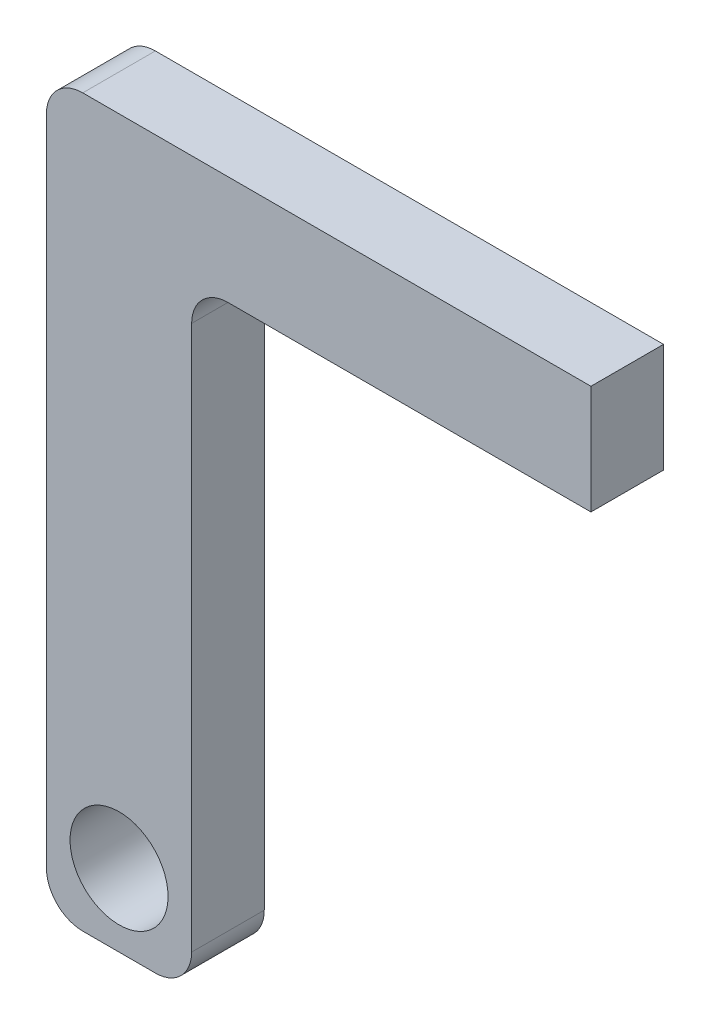
ISO-10303-21;
HEADER;
FILE_DESCRIPTION(('STEP AP214'),'2;1');
FILE_NAME('part.step','',(''),(''),'','','');
FILE_SCHEMA(('AUTOMOTIVE_DESIGN { 1 0 10303 214 1 1 1 1 }'));
ENDSEC;
DATA;
#1=APPLICATION_CONTEXT('core data for automotive mechanical design processes');
#2=APPLICATION_PROTOCOL_DEFINITION('international standard','automotive_design',2000,#1);
#3=PRODUCT_CONTEXT('',#1,'mechanical');
#4=PRODUCT('Part','Part','',(#3));
#5=PRODUCT_RELATED_PRODUCT_CATEGORY('part','',(#4));
#6=PRODUCT_DEFINITION_FORMATION('','',#4);
#7=PRODUCT_DEFINITION_CONTEXT('part definition',#1,'design');
#8=PRODUCT_DEFINITION('design','',#6,#7);
#9=PRODUCT_DEFINITION_SHAPE('','',#8);
#10=(LENGTH_UNIT() NAMED_UNIT(*) SI_UNIT(.MILLI.,.METRE.));
#11=(NAMED_UNIT(*) PLANE_ANGLE_UNIT() SI_UNIT($,.RADIAN.));
#12=(NAMED_UNIT(*) SI_UNIT($,.STERADIAN.) SOLID_ANGLE_UNIT());
#13=UNCERTAINTY_MEASURE_WITH_UNIT(LENGTH_MEASURE(1.E-05),#10,'distance_accuracy_value','');
#14=(GEOMETRIC_REPRESENTATION_CONTEXT(3) GLOBAL_UNCERTAINTY_ASSIGNED_CONTEXT((#13)) GLOBAL_UNIT_ASSIGNED_CONTEXT((#10,
#11,#12)) REPRESENTATION_CONTEXT('',''));
#15=CARTESIAN_POINT('',(0.,0.,0.));
#16=DIRECTION('',(0.,0.,1.));
#17=DIRECTION('',(1.,0.,0.));
#18=AXIS2_PLACEMENT_3D('',#15,#16,#17);
#19=CARTESIAN_POINT('',(20.,85.,20.));
#20=DIRECTION('',(-1.,0.,0.));
#21=DIRECTION('',(0.,-1.,0.));
#22=AXIS2_PLACEMENT_3D('',#19,#20,#21);
#23=PLANE('',#22);
#24=DIRECTION('',(0.,1.,0.));
#25=VECTOR('',#24,1.);
#26=CARTESIAN_POINT('',(20.,85.,0.));
#27=LINE('',#26,#25);
#28=CARTESIAN_POINT('',(20.,-75.,0.));
#29=VERTEX_POINT('',#28);
#30=CARTESIAN_POINT('',(20.,75.,0.));
#31=VERTEX_POINT('',#30);
#32=EDGE_CURVE('E129',#29,#31,#27,.T.);
#33=ORIENTED_EDGE('',*,*,#32,.T.);
#34=DIRECTION('',(0.,0.,-1.));
#35=VECTOR('',#34,1.);
#36=CARTESIAN_POINT('',(20.,75.,20.));
#37=LINE('',#36,#35);
#38=CARTESIAN_POINT('',(20.,75.,20.));
#39=VERTEX_POINT('',#38);
#40=EDGE_CURVE('E53',#31,#39,#37,.F.);
#41=ORIENTED_EDGE('',*,*,#40,.T.);
#42=DIRECTION('',(0.,1.,0.));
#43=VECTOR('',#42,1.);
#44=CARTESIAN_POINT('',(20.,85.,20.));
#45=LINE('',#44,#43);
#46=CARTESIAN_POINT('',(20.,-75.,20.));
#47=VERTEX_POINT('',#46);
#48=EDGE_CURVE('E185',#47,#39,#45,.T.);
#49=ORIENTED_EDGE('',*,*,#48,.F.);
#50=DIRECTION('',(0.,0.,-1.));
#51=VECTOR('',#50,1.);
#52=CARTESIAN_POINT('',(20.,-75.,20.));
#53=LINE('',#52,#51);
#54=EDGE_CURVE('E181',#47,#29,#53,.T.);
#55=ORIENTED_EDGE('',*,*,#54,.T.);
#56=EDGE_LOOP('',(#33,#41,#49,#55));
#57=FACE_BOUND('',#56,.T.);
#58=ADVANCED_FACE('F32',(#57),#23,.F.);
#59=CARTESIAN_POINT('',(-20.,85.,20.));
#60=DIRECTION('',(1.,0.,0.));
#61=DIRECTION('',(0.,1.,0.));
#62=AXIS2_PLACEMENT_3D('',#59,#60,#61);
#63=PLANE('',#62);
#64=DIRECTION('',(0.,-1.,0.));
#65=VECTOR('',#64,1.);
#66=CARTESIAN_POINT('',(-20.,85.,0.));
#67=LINE('',#66,#65);
#68=CARTESIAN_POINT('',(-20.,105.,0.));
#69=VERTEX_POINT('',#68);
#70=CARTESIAN_POINT('',(-20.,-75.,0.));
#71=VERTEX_POINT('',#70);
#72=EDGE_CURVE('E196',#69,#71,#67,.T.);
#73=ORIENTED_EDGE('',*,*,#72,.T.);
#74=DIRECTION('',(0.,0.,-1.));
#75=VECTOR('',#74,1.);
#76=CARTESIAN_POINT('',(-20.,-75.,20.));
#77=LINE('',#76,#75);
#78=CARTESIAN_POINT('',(-20.,-75.,20.));
#79=VERTEX_POINT('',#78);
#80=EDGE_CURVE('E155',#71,#79,#77,.F.);
#81=ORIENTED_EDGE('',*,*,#80,.T.);
#82=DIRECTION('',(0.,-1.,0.));
#83=VECTOR('',#82,1.);
#84=CARTESIAN_POINT('',(-20.,85.,20.));
#85=LINE('',#84,#83);
#86=CARTESIAN_POINT('',(-20.,105.,20.));
#87=VERTEX_POINT('',#86);
#88=EDGE_CURVE('E188',#87,#79,#85,.T.);
#89=ORIENTED_EDGE('',*,*,#88,.F.);
#90=DIRECTION('',(0.,0.,1.));
#91=VECTOR('',#90,1.);
#92=CARTESIAN_POINT('',(-20.,105.,0.));
#93=LINE('',#92,#91);
#94=EDGE_CURVE('E156',#87,#69,#93,.F.);
#95=ORIENTED_EDGE('',*,*,#94,.T.);
#96=EDGE_LOOP('',(#73,#81,#89,#95));
#97=FACE_BOUND('',#96,.T.);
#98=ADVANCED_FACE('F221',(#97),#63,.F.);
#99=CARTESIAN_POINT('',(-20.,-85.,20.));
#100=DIRECTION('',(0.,1.,0.));
#101=DIRECTION('',(0.,0.,1.));
#102=AXIS2_PLACEMENT_3D('',#99,#100,#101);
#103=PLANE('',#102);
#104=DIRECTION('',(1.,0.,0.));
#105=VECTOR('',#104,1.);
#106=CARTESIAN_POINT('',(-20.,-85.,0.));
#107=LINE('',#106,#105);
#108=CARTESIAN_POINT('',(-10.,-85.,0.));
#109=VERTEX_POINT('',#108);
#110=CARTESIAN_POINT('',(10.,-85.,0.));
#111=VERTEX_POINT('',#110);
#112=EDGE_CURVE('E189',#109,#111,#107,.T.);
#113=ORIENTED_EDGE('',*,*,#112,.T.);
#114=DIRECTION('',(0.,0.,-1.));
#115=VECTOR('',#114,1.);
#116=CARTESIAN_POINT('',(10.,-85.,20.));
#117=LINE('',#116,#115);
#118=CARTESIAN_POINT('',(10.,-85.,20.));
#119=VERTEX_POINT('',#118);
#120=EDGE_CURVE('E170',#111,#119,#117,.F.);
#121=ORIENTED_EDGE('',*,*,#120,.T.);
#122=DIRECTION('',(1.,0.,0.));
#123=VECTOR('',#122,1.);
#124=CARTESIAN_POINT('',(-20.,-85.,20.));
#125=LINE('',#124,#123);
#126=CARTESIAN_POINT('',(-10.,-85.,20.));
#127=VERTEX_POINT('',#126);
#128=EDGE_CURVE('E184',#127,#119,#125,.T.);
#129=ORIENTED_EDGE('',*,*,#128,.F.);
#130=DIRECTION('',(0.,0.,-1.));
#131=VECTOR('',#130,1.);
#132=CARTESIAN_POINT('',(-10.,-85.,20.));
#133=LINE('',#132,#131);
#134=EDGE_CURVE('E172',#127,#109,#133,.T.);
#135=ORIENTED_EDGE('',*,*,#134,.T.);
#136=EDGE_LOOP('',(#113,#121,#129,#135));
#137=FACE_BOUND('',#136,.T.);
#138=ADVANCED_FACE('F213',(#137),#103,.F.);
#139=CARTESIAN_POINT('',(0.,0.,20.));
#140=DIRECTION('',(0.,0.,1.));
#141=DIRECTION('',(1.,0.,0.));
#142=AXIS2_PLACEMENT_3D('',#139,#140,#141);
#143=PLANE('',#142);
#144=CARTESIAN_POINT('',(0.,-65.,20.));
#145=DIRECTION('',(0.,0.,1.));
#146=DIRECTION('',(1.,0.,0.));
#147=AXIS2_PLACEMENT_3D('',#144,#145,#146);
#148=CIRCLE('',#147,13.5);
#149=CARTESIAN_POINT('',(13.5,-65.,20.));
#150=VERTEX_POINT('',#149);
#151=EDGE_CURVE('E343',#150,#150,#148,.T.);
#152=ORIENTED_EDGE('',*,*,#151,.F.);
#153=EDGE_LOOP('',(#152));
#154=FACE_BOUND('',#153,.T.);
#155=ORIENTED_EDGE('',*,*,#128,.T.);
#156=CARTESIAN_POINT('',(10.,-75.,20.));
#157=DIRECTION('',(0.,0.,1.));
#158=DIRECTION('',(1.,0.,0.));
#159=AXIS2_PLACEMENT_3D('',#156,#157,#158);
#160=CIRCLE('',#159,10.);
#161=EDGE_CURVE('E162',#119,#47,#160,.T.);
#162=ORIENTED_EDGE('',*,*,#161,.T.);
#163=ORIENTED_EDGE('',*,*,#48,.T.);
#164=CARTESIAN_POINT('',(30.,75.,20.));
#165=DIRECTION('',(0.,0.,1.));
#166=DIRECTION('',(1.,0.,0.));
#167=AXIS2_PLACEMENT_3D('',#164,#165,#166);
#168=CIRCLE('',#167,10.);
#169=CARTESIAN_POINT('',(30.,85.,20.));
#170=VERTEX_POINT('',#169);
#171=EDGE_CURVE('E11',#39,#170,#168,.F.);
#172=ORIENTED_EDGE('',*,*,#171,.T.);
#173=DIRECTION('',(1.,0.,0.));
#174=VECTOR('',#173,1.);
#175=CARTESIAN_POINT('',(-20.,85.,20.));
#176=LINE('',#175,#174);
#177=CARTESIAN_POINT('',(130.,85.,20.));
#178=VERTEX_POINT('',#177);
#179=EDGE_CURVE('E126',#170,#178,#176,.T.);
#180=ORIENTED_EDGE('',*,*,#179,.T.);
#181=DIRECTION('',(0.,-1.,0.));
#182=VECTOR('',#181,1.);
#183=CARTESIAN_POINT('',(130.,115.,20.));
#184=LINE('',#183,#182);
#185=CARTESIAN_POINT('',(130.,115.,20.));
#186=VERTEX_POINT('',#185);
#187=EDGE_CURVE('E122',#186,#178,#184,.T.);
#188=ORIENTED_EDGE('',*,*,#187,.F.);
#189=DIRECTION('',(1.,0.,0.));
#190=VECTOR('',#189,1.);
#191=CARTESIAN_POINT('',(-20.,115.,20.));
#192=LINE('',#191,#190);
#193=CARTESIAN_POINT('',(-10.,115.,20.));
#194=VERTEX_POINT('',#193);
#195=EDGE_CURVE('E109',#194,#186,#192,.T.);
#196=ORIENTED_EDGE('',*,*,#195,.F.);
#197=CARTESIAN_POINT('',(-10.,105.,20.));
#198=DIRECTION('',(0.,0.,1.));
#199=DIRECTION('',(1.,0.,0.));
#200=AXIS2_PLACEMENT_3D('',#197,#198,#199);
#201=CIRCLE('',#200,10.);
#202=EDGE_CURVE('E168',#194,#87,#201,.T.);
#203=ORIENTED_EDGE('',*,*,#202,.T.);
#204=ORIENTED_EDGE('',*,*,#88,.T.);
#205=CARTESIAN_POINT('',(-10.,-75.,20.));
#206=DIRECTION('',(0.,0.,1.));
#207=DIRECTION('',(1.,0.,0.));
#208=AXIS2_PLACEMENT_3D('',#205,#206,#207);
#209=CIRCLE('',#208,10.);
#210=EDGE_CURVE('E166',#79,#127,#209,.T.);
#211=ORIENTED_EDGE('',*,*,#210,.T.);
#212=EDGE_LOOP('',(#155,#162,#163,#172,#180,#188,#196,#203,#204,#211));
#213=FACE_BOUND('',#212,.T.);
#214=ADVANCED_FACE('F124',(#154,#213),#143,.T.);
#215=CARTESIAN_POINT('',(0.,0.,0.));
#216=DIRECTION('',(0.,0.,1.));
#217=DIRECTION('',(1.,0.,0.));
#218=AXIS2_PLACEMENT_3D('',#215,#216,#217);
#219=PLANE('',#218);
#220=CARTESIAN_POINT('',(0.,-65.,0.));
#221=DIRECTION('',(0.,0.,1.));
#222=DIRECTION('',(1.,0.,0.));
#223=AXIS2_PLACEMENT_3D('',#220,#221,#222);
#224=CIRCLE('',#223,13.5);
#225=CARTESIAN_POINT('',(13.5,-65.,0.));
#226=VERTEX_POINT('',#225);
#227=EDGE_CURVE('E147',#226,#226,#224,.F.);
#228=ORIENTED_EDGE('',*,*,#227,.F.);
#229=EDGE_LOOP('',(#228));
#230=FACE_BOUND('',#229,.T.);
#231=ORIENTED_EDGE('',*,*,#32,.F.);
#232=CARTESIAN_POINT('',(10.,-75.,0.));
#233=DIRECTION('',(0.,0.,1.));
#234=DIRECTION('',(1.,0.,0.));
#235=AXIS2_PLACEMENT_3D('',#232,#233,#234);
#236=CIRCLE('',#235,10.);
#237=EDGE_CURVE('E175',#29,#111,#236,.F.);
#238=ORIENTED_EDGE('',*,*,#237,.T.);
#239=ORIENTED_EDGE('',*,*,#112,.F.);
#240=CARTESIAN_POINT('',(-10.,-75.,0.));
#241=DIRECTION('',(0.,0.,1.));
#242=DIRECTION('',(1.,0.,0.));
#243=AXIS2_PLACEMENT_3D('',#240,#241,#242);
#244=CIRCLE('',#243,10.);
#245=EDGE_CURVE('E177',#109,#71,#244,.F.);
#246=ORIENTED_EDGE('',*,*,#245,.T.);
#247=ORIENTED_EDGE('',*,*,#72,.F.);
#248=CARTESIAN_POINT('',(-10.,105.,0.));
#249=DIRECTION('',(0.,0.,1.));
#250=DIRECTION('',(1.,0.,0.));
#251=AXIS2_PLACEMENT_3D('',#248,#249,#250);
#252=CIRCLE('',#251,10.);
#253=CARTESIAN_POINT('',(-10.,115.,0.));
#254=VERTEX_POINT('',#253);
#255=EDGE_CURVE('E179',#69,#254,#252,.F.);
#256=ORIENTED_EDGE('',*,*,#255,.T.);
#257=DIRECTION('',(-1.,0.,0.));
#258=VECTOR('',#257,1.);
#259=CARTESIAN_POINT('',(-20.,115.,0.));
#260=LINE('',#259,#258);
#261=CARTESIAN_POINT('',(130.,115.,0.));
#262=VERTEX_POINT('',#261);
#263=EDGE_CURVE('E135',#262,#254,#260,.T.);
#264=ORIENTED_EDGE('',*,*,#263,.F.);
#265=DIRECTION('',(0.,-1.,0.));
#266=VECTOR('',#265,1.);
#267=CARTESIAN_POINT('',(130.,115.,0.));
#268=LINE('',#267,#266);
#269=CARTESIAN_POINT('',(130.,85.,0.));
#270=VERTEX_POINT('',#269);
#271=EDGE_CURVE('E130',#262,#270,#268,.T.);
#272=ORIENTED_EDGE('',*,*,#271,.T.);
#273=DIRECTION('',(-1.,0.,0.));
#274=VECTOR('',#273,1.);
#275=CARTESIAN_POINT('',(-20.,85.,0.));
#276=LINE('',#275,#274);
#277=CARTESIAN_POINT('',(30.,85.,0.));
#278=VERTEX_POINT('',#277);
#279=EDGE_CURVE('E119',#270,#278,#276,.T.);
#280=ORIENTED_EDGE('',*,*,#279,.T.);
#281=CARTESIAN_POINT('',(30.,75.,0.));
#282=DIRECTION('',(0.,0.,1.));
#283=DIRECTION('',(1.,0.,0.));
#284=AXIS2_PLACEMENT_3D('',#281,#282,#283);
#285=CIRCLE('',#284,10.);
#286=EDGE_CURVE('E40',#278,#31,#285,.T.);
#287=ORIENTED_EDGE('',*,*,#286,.T.);
#288=EDGE_LOOP('',(#231,#238,#239,#246,#247,#256,#264,#272,#280,#287));
#289=FACE_BOUND('',#288,.T.);
#290=ADVANCED_FACE('F202',(#230,#289),#219,.F.);
#291=CARTESIAN_POINT('',(0.,85.,0.));
#292=DIRECTION('',(0.,1.,0.));
#293=DIRECTION('',(0.,0.,1.));
#294=AXIS2_PLACEMENT_3D('',#291,#292,#293);
#295=PLANE('',#294);
#296=ORIENTED_EDGE('',*,*,#179,.F.);
#297=DIRECTION('',(0.,0.,-1.));
#298=VECTOR('',#297,1.);
#299=CARTESIAN_POINT('',(30.,85.,0.));
#300=LINE('',#299,#298);
#301=EDGE_CURVE('E149',#170,#278,#300,.T.);
#302=ORIENTED_EDGE('',*,*,#301,.T.);
#303=ORIENTED_EDGE('',*,*,#279,.F.);
#304=DIRECTION('',(0.,0.,-1.));
#305=VECTOR('',#304,1.);
#306=CARTESIAN_POINT('',(130.,85.,0.));
#307=LINE('',#306,#305);
#308=EDGE_CURVE('E142',#178,#270,#307,.T.);
#309=ORIENTED_EDGE('',*,*,#308,.F.);
#310=EDGE_LOOP('',(#296,#302,#303,#309));
#311=FACE_BOUND('',#310,.T.);
#312=ADVANCED_FACE('F203',(#311),#295,.F.);
#313=CARTESIAN_POINT('',(130.,115.,0.));
#314=DIRECTION('',(-1.,0.,0.));
#315=DIRECTION('',(0.,0.,1.));
#316=AXIS2_PLACEMENT_3D('',#313,#314,#315);
#317=PLANE('',#316);
#318=ORIENTED_EDGE('',*,*,#308,.T.);
#319=ORIENTED_EDGE('',*,*,#271,.F.);
#320=DIRECTION('',(0.,0.,-1.));
#321=VECTOR('',#320,1.);
#322=CARTESIAN_POINT('',(130.,115.,0.));
#323=LINE('',#322,#321);
#324=EDGE_CURVE('E114',#186,#262,#323,.T.);
#325=ORIENTED_EDGE('',*,*,#324,.F.);
#326=ORIENTED_EDGE('',*,*,#187,.T.);
#327=EDGE_LOOP('',(#318,#319,#325,#326));
#328=FACE_BOUND('',#327,.T.);
#329=ADVANCED_FACE('F132',(#328),#317,.F.);
#330=CARTESIAN_POINT('',(0.,115.,0.));
#331=DIRECTION('',(0.,1.,0.));
#332=DIRECTION('',(0.,0.,1.));
#333=AXIS2_PLACEMENT_3D('',#330,#331,#332);
#334=PLANE('',#333);
#335=ORIENTED_EDGE('',*,*,#263,.T.);
#336=DIRECTION('',(0.,0.,1.));
#337=VECTOR('',#336,1.);
#338=CARTESIAN_POINT('',(-10.,115.,20.));
#339=LINE('',#338,#337);
#340=EDGE_CURVE('E117',#254,#194,#339,.T.);
#341=ORIENTED_EDGE('',*,*,#340,.T.);
#342=ORIENTED_EDGE('',*,*,#195,.T.);
#343=ORIENTED_EDGE('',*,*,#324,.T.);
#344=EDGE_LOOP('',(#335,#341,#342,#343));
#345=FACE_BOUND('',#344,.T.);
#346=ADVANCED_FACE('F112',(#345),#334,.T.);
#347=CARTESIAN_POINT('',(10.,-75.,20.));
#348=DIRECTION('',(0.,0.,-1.));
#349=DIRECTION('',(-1.,0.,0.));
#350=AXIS2_PLACEMENT_3D('',#347,#348,#349);
#351=CYLINDRICAL_SURFACE('',#350,10.);
#352=ORIENTED_EDGE('',*,*,#161,.F.);
#353=ORIENTED_EDGE('',*,*,#120,.F.);
#354=ORIENTED_EDGE('',*,*,#237,.F.);
#355=ORIENTED_EDGE('',*,*,#54,.F.);
#356=EDGE_LOOP('',(#352,#353,#354,#355));
#357=FACE_BOUND('',#356,.T.);
#358=ADVANCED_FACE('F209',(#357),#351,.T.);
#359=CARTESIAN_POINT('',(-10.,-75.,20.));
#360=DIRECTION('',(0.,0.,-1.));
#361=DIRECTION('',(-1.,0.,0.));
#362=AXIS2_PLACEMENT_3D('',#359,#360,#361);
#363=CYLINDRICAL_SURFACE('',#362,10.);
#364=ORIENTED_EDGE('',*,*,#210,.F.);
#365=ORIENTED_EDGE('',*,*,#80,.F.);
#366=ORIENTED_EDGE('',*,*,#245,.F.);
#367=ORIENTED_EDGE('',*,*,#134,.F.);
#368=EDGE_LOOP('',(#364,#365,#366,#367));
#369=FACE_BOUND('',#368,.T.);
#370=ADVANCED_FACE('F218',(#369),#363,.T.);
#371=CARTESIAN_POINT('',(-10.,105.,0.));
#372=DIRECTION('',(0.,0.,-1.));
#373=DIRECTION('',(-1.,0.,0.));
#374=AXIS2_PLACEMENT_3D('',#371,#372,#373);
#375=CYLINDRICAL_SURFACE('',#374,10.);
#376=ORIENTED_EDGE('',*,*,#255,.F.);
#377=ORIENTED_EDGE('',*,*,#94,.F.);
#378=ORIENTED_EDGE('',*,*,#202,.F.);
#379=ORIENTED_EDGE('',*,*,#340,.F.);
#380=EDGE_LOOP('',(#376,#377,#378,#379));
#381=FACE_BOUND('',#380,.T.);
#382=ADVANCED_FACE('F224',(#381),#375,.T.);
#383=CARTESIAN_POINT('',(0.,-65.,-0.00104999999999897));
#384=DIRECTION('',(0.,0.,1.));
#385=DIRECTION('',(1.,0.,0.));
#386=AXIS2_PLACEMENT_3D('',#383,#384,#385);
#387=CYLINDRICAL_SURFACE('',#386,13.5);
#388=ORIENTED_EDGE('',*,*,#151,.T.);
#389=EDGE_LOOP('',(#388));
#390=FACE_BOUND('',#389,.T.);
#391=ORIENTED_EDGE('',*,*,#227,.T.);
#392=EDGE_LOOP('',(#391));
#393=FACE_BOUND('',#392,.T.);
#394=ADVANCED_FACE('F226',(#390,#393),#387,.F.);
#395=CARTESIAN_POINT('',(30.,75.,0.));
#396=DIRECTION('',(0.,0.,1.));
#397=DIRECTION('',(1.,0.,0.));
#398=AXIS2_PLACEMENT_3D('',#395,#396,#397);
#399=CYLINDRICAL_SURFACE('',#398,10.);
#400=ORIENTED_EDGE('',*,*,#171,.F.);
#401=ORIENTED_EDGE('',*,*,#40,.F.);
#402=ORIENTED_EDGE('',*,*,#286,.F.);
#403=ORIENTED_EDGE('',*,*,#301,.F.);
#404=EDGE_LOOP('',(#400,#401,#402,#403));
#405=FACE_BOUND('',#404,.T.);
#406=ADVANCED_FACE('F34',(#405),#399,.F.);
#407=CLOSED_SHELL('',(#58,#98,#138,#214,#290,#312,#329,#346,#358,#370,#382,#394,#406));
#408=MANIFOLD_SOLID_BREP('B2',#407);
#409=ADVANCED_BREP_SHAPE_REPRESENTATION('',(#18,#408),#14);
#410=SHAPE_DEFINITION_REPRESENTATION(#9,#409);
ENDSEC;
END-ISO-10303-21;
